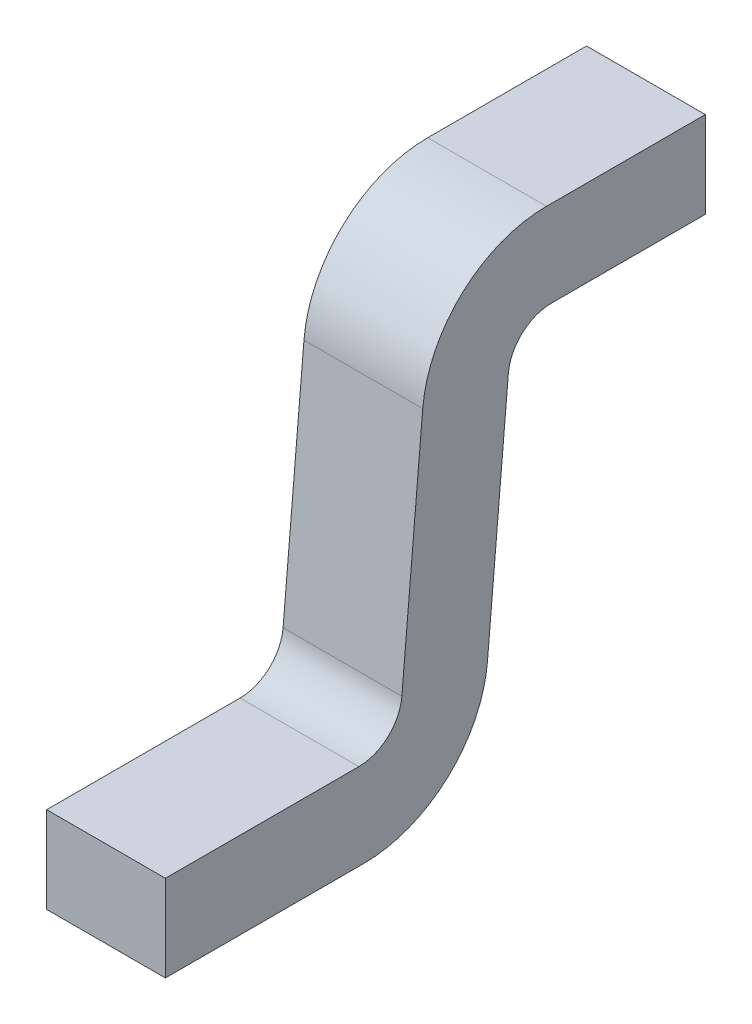
ISO-10303-21;
HEADER;
FILE_DESCRIPTION(('STEP AP214'),'2;1');
FILE_NAME('part.step','',(''),(''),'','','');
FILE_SCHEMA(('AUTOMOTIVE_DESIGN { 1 0 10303 214 1 1 1 1 }'));
ENDSEC;
DATA;
#1=APPLICATION_CONTEXT('core data for automotive mechanical design processes');
#2=APPLICATION_PROTOCOL_DEFINITION('international standard','automotive_design',2000,#1);
#3=PRODUCT_CONTEXT('',#1,'mechanical');
#4=PRODUCT('Part','Part','',(#3));
#5=PRODUCT_RELATED_PRODUCT_CATEGORY('part','',(#4));
#6=PRODUCT_DEFINITION_FORMATION('','',#4);
#7=PRODUCT_DEFINITION_CONTEXT('part definition',#1,'design');
#8=PRODUCT_DEFINITION('design','',#6,#7);
#9=PRODUCT_DEFINITION_SHAPE('','',#8);
#10=(LENGTH_UNIT() NAMED_UNIT(*) SI_UNIT(.MILLI.,.METRE.));
#11=(NAMED_UNIT(*) PLANE_ANGLE_UNIT() SI_UNIT($,.RADIAN.));
#12=(NAMED_UNIT(*) SI_UNIT($,.STERADIAN.) SOLID_ANGLE_UNIT());
#13=UNCERTAINTY_MEASURE_WITH_UNIT(LENGTH_MEASURE(1.E-05),#10,'distance_accuracy_value','');
#14=(GEOMETRIC_REPRESENTATION_CONTEXT(3) GLOBAL_UNCERTAINTY_ASSIGNED_CONTEXT((#13)) GLOBAL_UNIT_ASSIGNED_CONTEXT((#10,
#11,#12)) REPRESENTATION_CONTEXT('',''));
#15=CARTESIAN_POINT('',(0.,0.,0.));
#16=DIRECTION('',(0.,0.,1.));
#17=DIRECTION('',(1.,0.,0.));
#18=AXIS2_PLACEMENT_3D('',#15,#16,#17);
#19=CARTESIAN_POINT('',(0.11,0.,0.));
#20=DIRECTION('',(1.,0.,0.));
#21=DIRECTION('',(0.,0.,-1.));
#22=AXIS2_PLACEMENT_3D('',#19,#20,#21);
#23=PLANE('',#22);
#24=CARTESIAN_POINT('',(0.11,0.405,-0.105700297356));
#25=DIRECTION('',(-1.,0.,0.));
#26=DIRECTION('',(0.,0.,1.));
#27=AXIS2_PLACEMENT_3D('',#24,#25,#26);
#28=CIRCLE('',#27,0.23);
#29=CARTESIAN_POINT('',(0.11,0.42504582083198,0.123424483205085));
#30=VERTEX_POINT('',#29);
#31=CARTESIAN_POINT('',(0.11,0.635,-0.105700297356));
#32=VERTEX_POINT('',#31);
#33=EDGE_CURVE('E195',#30,#32,#28,.T.);
#34=ORIENTED_EDGE('',*,*,#33,.F.);
#35=DIRECTION('',(0.,-0.996194698091745,0.0871557427476639));
#36=VECTOR('',#35,1.);
#37=CARTESIAN_POINT('',(0.11,0.01394491883963,0.1593911516947));
#38=LINE('',#37,#36);
#39=CARTESIAN_POINT('',(0.11,-0.0169724594198097,0.162096071798352));
#40=VERTEX_POINT('',#39);
#41=EDGE_CURVE('E192',#40,#30,#38,.F.);
#42=ORIENTED_EDGE('',*,*,#41,.F.);
#43=CARTESIAN_POINT('',(0.11,-0.01,0.2417916476457));
#44=DIRECTION('',(1.,0.,0.));
#45=DIRECTION('',(0.,0.,-1.));
#46=AXIS2_PLACEMENT_3D('',#43,#44,#45);
#47=CIRCLE('',#46,0.08);
#48=CARTESIAN_POINT('',(0.11,-0.09,0.2417916476457));
#49=VERTEX_POINT('',#48);
#50=EDGE_CURVE('E189',#40,#49,#47,.F.);
#51=ORIENTED_EDGE('',*,*,#50,.T.);
#52=DIRECTION('',(0.,0.,1.));
#53=VECTOR('',#52,1.);
#54=CARTESIAN_POINT('',(0.11,-0.09,0.1684851537243));
#55=LINE('',#54,#53);
#56=CARTESIAN_POINT('',(0.11,-0.09,0.6));
#57=VERTEX_POINT('',#56);
#58=EDGE_CURVE('E185',#57,#49,#55,.F.);
#59=ORIENTED_EDGE('',*,*,#58,.F.);
#60=DIRECTION('',(0.,1.,0.));
#61=VECTOR('',#60,1.);
#62=CARTESIAN_POINT('',(0.11,-0.09,0.6));
#63=LINE('',#62,#61);
#64=CARTESIAN_POINT('',(0.11,-0.25,0.6));
#65=VERTEX_POINT('',#64);
#66=EDGE_CURVE('E125',#65,#57,#63,.T.);
#67=ORIENTED_EDGE('',*,*,#66,.F.);
#68=DIRECTION('',(0.,0.,-1.));
#69=VECTOR('',#68,1.);
#70=CARTESIAN_POINT('',(0.11,-0.25,0.6));
#71=LINE('',#70,#69);
#72=CARTESIAN_POINT('',(0.11,-0.25,0.2326283359055));
#73=VERTEX_POINT('',#72);
#74=EDGE_CURVE('E129',#73,#65,#71,.F.);
#75=ORIENTED_EDGE('',*,*,#74,.F.);
#76=CARTESIAN_POINT('',(0.11,-0.02,0.2326283359055));
#77=DIRECTION('',(-1.,0.,0.));
#78=DIRECTION('',(0.,0.,1.));
#79=AXIS2_PLACEMENT_3D('',#76,#77,#78);
#80=CIRCLE('',#79,0.23);
#81=CARTESIAN_POINT('',(0.11,-0.0400458208319614,0.00350355534439158));
#82=VERTEX_POINT('',#81);
#83=EDGE_CURVE('E173',#82,#73,#80,.T.);
#84=ORIENTED_EDGE('',*,*,#83,.F.);
#85=DIRECTION('',(0.,0.996194698091745,-0.0871557427476639));
#86=VECTOR('',#85,1.);
#87=CARTESIAN_POINT('',(0.11,-0.25,0.02187216588148));
#88=LINE('',#87,#86);
#89=CARTESIAN_POINT('',(0.11,0.401972459419806,-0.0351680332488661));
#90=VERTEX_POINT('',#89);
#91=EDGE_CURVE('E89',#90,#82,#88,.F.);
#92=ORIENTED_EDGE('',*,*,#91,.F.);
#93=CARTESIAN_POINT('',(0.11,0.395,-0.1148636090962));
#94=DIRECTION('',(1.,0.,0.));
#95=DIRECTION('',(0.,0.,-1.));
#96=AXIS2_PLACEMENT_3D('',#93,#94,#95);
#97=CIRCLE('',#96,0.08);
#98=CARTESIAN_POINT('',(0.11,0.475,-0.1148636090962));
#99=VERTEX_POINT('',#98);
#100=EDGE_CURVE('E19',#90,#99,#97,.F.);
#101=ORIENTED_EDGE('',*,*,#100,.T.);
#102=DIRECTION('',(0.,0.,-1.));
#103=VECTOR('',#102,1.);
#104=CARTESIAN_POINT('',(0.11,0.475,-0.04155711517481));
#105=LINE('',#104,#103);
#106=CARTESIAN_POINT('',(0.11,0.475,-0.4));
#107=VERTEX_POINT('',#106);
#108=EDGE_CURVE('E95',#107,#99,#105,.F.);
#109=ORIENTED_EDGE('',*,*,#108,.F.);
#110=DIRECTION('',(0.,1.,0.));
#111=VECTOR('',#110,1.);
#112=CARTESIAN_POINT('',(0.11,0.475,-0.4));
#113=LINE('',#112,#111);
#114=CARTESIAN_POINT('',(0.11,0.635,-0.4));
#115=VERTEX_POINT('',#114);
#116=EDGE_CURVE('E101',#115,#107,#113,.F.);
#117=ORIENTED_EDGE('',*,*,#116,.F.);
#118=DIRECTION('',(0.,0.,1.));
#119=VECTOR('',#118,1.);
#120=CARTESIAN_POINT('',(0.11,0.635,-0.4));
#121=LINE('',#120,#119);
#122=EDGE_CURVE('E107',#32,#115,#121,.F.);
#123=ORIENTED_EDGE('',*,*,#122,.F.);
#124=EDGE_LOOP('',(#34,#42,#51,#59,#67,#75,#84,#92,#101,#109,#117,#123));
#125=FACE_BOUND('',#124,.T.);
#126=ADVANCED_FACE('F16',(#125),#23,.T.);
#127=CARTESIAN_POINT('',(-0.11,-0.25,0.02187216588148));
#128=DIRECTION('',(0.,-0.0871557427476639,-0.996194698091745));
#129=DIRECTION('',(0.,0.996194698091745,-0.0871557427476639));
#130=AXIS2_PLACEMENT_3D('',#127,#128,#129);
#131=PLANE('',#130);
#132=DIRECTION('',(1.,0.,0.));
#133=VECTOR('',#132,1.);
#134=CARTESIAN_POINT('',(-0.11,0.401972459419801,-0.0351680332488593));
#135=LINE('',#134,#133);
#136=CARTESIAN_POINT('',(-0.11,0.401972459419807,-0.0351680332488652));
#137=VERTEX_POINT('',#136);
#138=EDGE_CURVE('E210',#137,#90,#135,.T.);
#139=ORIENTED_EDGE('',*,*,#138,.T.);
#140=ORIENTED_EDGE('',*,*,#91,.T.);
#141=DIRECTION('',(-1.,0.,0.));
#142=VECTOR('',#141,1.);
#143=CARTESIAN_POINT('',(-0.11,-0.040045820831959,0.00350355534439829));
#144=LINE('',#143,#142);
#145=CARTESIAN_POINT('',(-0.11,-0.0400458208319615,0.00350355534439284));
#146=VERTEX_POINT('',#145);
#147=EDGE_CURVE('E171',#146,#82,#144,.F.);
#148=ORIENTED_EDGE('',*,*,#147,.F.);
#149=DIRECTION('',(0.,0.996194698091745,-0.0871557427476653));
#150=VECTOR('',#149,1.);
#151=CARTESIAN_POINT('',(-0.11,-0.04004582083196,0.003503555344387));
#152=LINE('',#151,#150);
#153=EDGE_CURVE('E168',#146,#137,#152,.T.);
#154=ORIENTED_EDGE('',*,*,#153,.T.);
#155=EDGE_LOOP('',(#139,#140,#148,#154));
#156=FACE_BOUND('',#155,.T.);
#157=ADVANCED_FACE('F256',(#156),#131,.T.);
#158=CARTESIAN_POINT('',(-0.11,0.395,-0.1148636090962));
#159=DIRECTION('',(1.,0.,0.));
#160=DIRECTION('',(0.,0.,-1.));
#161=AXIS2_PLACEMENT_3D('',#158,#159,#160);
#162=CYLINDRICAL_SURFACE('',#161,0.08);
#163=ORIENTED_EDGE('',*,*,#138,.F.);
#164=CARTESIAN_POINT('',(-0.11,0.395,-0.1148636090962));
#165=DIRECTION('',(1.,0.,0.));
#166=DIRECTION('',(0.,0.,-1.));
#167=AXIS2_PLACEMENT_3D('',#164,#165,#166);
#168=CIRCLE('',#167,0.08);
#169=CARTESIAN_POINT('',(-0.11,0.475,-0.1148636090962));
#170=VERTEX_POINT('',#169);
#171=EDGE_CURVE('E165',#137,#170,#168,.F.);
#172=ORIENTED_EDGE('',*,*,#171,.T.);
#173=DIRECTION('',(1.,0.,0.));
#174=VECTOR('',#173,1.);
#175=CARTESIAN_POINT('',(-0.11,0.475,-0.1148636090962));
#176=LINE('',#175,#174);
#177=EDGE_CURVE('E208',#99,#170,#176,.F.);
#178=ORIENTED_EDGE('',*,*,#177,.F.);
#179=ORIENTED_EDGE('',*,*,#100,.F.);
#180=EDGE_LOOP('',(#163,#172,#178,#179));
#181=FACE_BOUND('',#180,.T.);
#182=ADVANCED_FACE('F254',(#181),#162,.F.);
#183=CARTESIAN_POINT('',(-0.11,0.475,-0.04155711517481));
#184=DIRECTION('',(0.,-1.,0.));
#185=DIRECTION('',(0.,0.,-1.));
#186=AXIS2_PLACEMENT_3D('',#183,#184,#185);
#187=PLANE('',#186);
#188=ORIENTED_EDGE('',*,*,#177,.T.);
#189=DIRECTION('',(0.,0.,-1.));
#190=VECTOR('',#189,1.);
#191=CARTESIAN_POINT('',(-0.11,0.475,0.));
#192=LINE('',#191,#190);
#193=CARTESIAN_POINT('',(-0.11,0.475,-0.4));
#194=VERTEX_POINT('',#193);
#195=EDGE_CURVE('E162',#170,#194,#192,.T.);
#196=ORIENTED_EDGE('',*,*,#195,.T.);
#197=DIRECTION('',(-1.,0.,0.));
#198=VECTOR('',#197,1.);
#199=CARTESIAN_POINT('',(-0.11,0.475,-0.4));
#200=LINE('',#199,#198);
#201=EDGE_CURVE('E204',#107,#194,#200,.T.);
#202=ORIENTED_EDGE('',*,*,#201,.F.);
#203=ORIENTED_EDGE('',*,*,#108,.T.);
#204=EDGE_LOOP('',(#188,#196,#202,#203));
#205=FACE_BOUND('',#204,.T.);
#206=ADVANCED_FACE('F250',(#205),#187,.T.);
#207=CARTESIAN_POINT('',(-0.11,0.475,-0.4));
#208=DIRECTION('',(0.,0.,-1.));
#209=DIRECTION('',(-1.,0.,0.));
#210=AXIS2_PLACEMENT_3D('',#207,#208,#209);
#211=PLANE('',#210);
#212=ORIENTED_EDGE('',*,*,#201,.T.);
#213=DIRECTION('',(0.,1.,0.));
#214=VECTOR('',#213,1.);
#215=CARTESIAN_POINT('',(-0.11,0.,-0.4));
#216=LINE('',#215,#214);
#217=CARTESIAN_POINT('',(-0.11,0.635,-0.4));
#218=VERTEX_POINT('',#217);
#219=EDGE_CURVE('E159',#194,#218,#216,.T.);
#220=ORIENTED_EDGE('',*,*,#219,.T.);
#221=DIRECTION('',(1.,0.,0.));
#222=VECTOR('',#221,1.);
#223=CARTESIAN_POINT('',(-0.11,0.635,-0.4));
#224=LINE('',#223,#222);
#225=EDGE_CURVE('E196',#115,#218,#224,.F.);
#226=ORIENTED_EDGE('',*,*,#225,.F.);
#227=ORIENTED_EDGE('',*,*,#116,.T.);
#228=EDGE_LOOP('',(#212,#220,#226,#227));
#229=FACE_BOUND('',#228,.T.);
#230=ADVANCED_FACE('F249',(#229),#211,.T.);
#231=CARTESIAN_POINT('',(-0.11,0.635,-0.4));
#232=DIRECTION('',(0.,1.,0.));
#233=DIRECTION('',(0.,0.,1.));
#234=AXIS2_PLACEMENT_3D('',#231,#232,#233);
#235=PLANE('',#234);
#236=ORIENTED_EDGE('',*,*,#225,.T.);
#237=DIRECTION('',(0.,0.,-1.));
#238=VECTOR('',#237,1.);
#239=CARTESIAN_POINT('',(-0.11,0.635,0.));
#240=LINE('',#239,#238);
#241=CARTESIAN_POINT('',(-0.11,0.635,-0.105700297356));
#242=VERTEX_POINT('',#241);
#243=EDGE_CURVE('E156',#218,#242,#240,.F.);
#244=ORIENTED_EDGE('',*,*,#243,.T.);
#245=DIRECTION('',(-1.,0.,0.));
#246=VECTOR('',#245,1.);
#247=CARTESIAN_POINT('',(-0.11,0.635,-0.105700297356));
#248=LINE('',#247,#246);
#249=EDGE_CURVE('E193',#32,#242,#248,.T.);
#250=ORIENTED_EDGE('',*,*,#249,.F.);
#251=ORIENTED_EDGE('',*,*,#122,.T.);
#252=EDGE_LOOP('',(#236,#244,#250,#251));
#253=FACE_BOUND('',#252,.T.);
#254=ADVANCED_FACE('F244',(#253),#235,.T.);
#255=CARTESIAN_POINT('',(-0.11,0.405,-0.105700297356));
#256=DIRECTION('',(-1.,0.,0.));
#257=DIRECTION('',(0.,0.,1.));
#258=AXIS2_PLACEMENT_3D('',#255,#256,#257);
#259=CYLINDRICAL_SURFACE('',#258,0.23);
#260=CARTESIAN_POINT('',(-0.11,0.405,-0.105700297356));
#261=DIRECTION('',(-1.,0.,0.));
#262=DIRECTION('',(0.,0.,1.));
#263=AXIS2_PLACEMENT_3D('',#260,#261,#262);
#264=CIRCLE('',#263,0.23);
#265=CARTESIAN_POINT('',(-0.11,0.425045820831965,0.123424483205095));
#266=VERTEX_POINT('',#265);
#267=EDGE_CURVE('E155',#242,#266,#264,.F.);
#268=ORIENTED_EDGE('',*,*,#267,.T.);
#269=DIRECTION('',(1.,0.,0.));
#270=VECTOR('',#269,1.);
#271=CARTESIAN_POINT('',(-0.11,0.425045820831999,0.123424483205083));
#272=LINE('',#271,#270);
#273=EDGE_CURVE('E190',#30,#266,#272,.F.);
#274=ORIENTED_EDGE('',*,*,#273,.F.);
#275=ORIENTED_EDGE('',*,*,#33,.T.);
#276=ORIENTED_EDGE('',*,*,#249,.T.);
#277=EDGE_LOOP('',(#268,#274,#275,#276));
#278=FACE_BOUND('',#277,.T.);
#279=ADVANCED_FACE('F242',(#278),#259,.T.);
#280=CARTESIAN_POINT('',(-0.11,0.01394491883963,0.1593911516947));
#281=DIRECTION('',(0.,0.0871557427476639,0.996194698091745));
#282=DIRECTION('',(0.,-0.996194698091745,0.0871557427476639));
#283=AXIS2_PLACEMENT_3D('',#280,#281,#282);
#284=PLANE('',#283);
#285=ORIENTED_EDGE('',*,*,#273,.T.);
#286=DIRECTION('',(0.,-0.996194698091757,0.087155742747528));
#287=VECTOR('',#286,1.);
#288=CARTESIAN_POINT('',(-0.11,0.425045820832,0.1234244832051));
#289=LINE('',#288,#287);
#290=CARTESIAN_POINT('',(-0.11,-0.0169724594198061,0.16209607179833));
#291=VERTEX_POINT('',#290);
#292=EDGE_CURVE('E145',#266,#291,#289,.T.);
#293=ORIENTED_EDGE('',*,*,#292,.T.);
#294=DIRECTION('',(1.,0.,0.));
#295=VECTOR('',#294,1.);
#296=CARTESIAN_POINT('',(-0.11,-0.0169724594198048,0.16209607179836));
#297=LINE('',#296,#295);
#298=EDGE_CURVE('E186',#291,#40,#297,.T.);
#299=ORIENTED_EDGE('',*,*,#298,.T.);
#300=ORIENTED_EDGE('',*,*,#41,.T.);
#301=EDGE_LOOP('',(#285,#293,#299,#300));
#302=FACE_BOUND('',#301,.T.);
#303=ADVANCED_FACE('F265',(#302),#284,.T.);
#304=CARTESIAN_POINT('',(-0.11,-0.01,0.2417916476457));
#305=DIRECTION('',(1.,0.,0.));
#306=DIRECTION('',(0.,0.,-1.));
#307=AXIS2_PLACEMENT_3D('',#304,#305,#306);
#308=CYLINDRICAL_SURFACE('',#307,0.08);
#309=ORIENTED_EDGE('',*,*,#298,.F.);
#310=CARTESIAN_POINT('',(-0.11,-0.01,0.2417916476457));
#311=DIRECTION('',(1.,0.,0.));
#312=DIRECTION('',(0.,0.,-1.));
#313=AXIS2_PLACEMENT_3D('',#310,#311,#312);
#314=CIRCLE('',#313,0.08);
#315=CARTESIAN_POINT('',(-0.11,-0.09,0.2417916476457));
#316=VERTEX_POINT('',#315);
#317=EDGE_CURVE('E143',#291,#316,#314,.F.);
#318=ORIENTED_EDGE('',*,*,#317,.T.);
#319=DIRECTION('',(1.,0.,0.));
#320=VECTOR('',#319,1.);
#321=CARTESIAN_POINT('',(-0.11,-0.09,0.2417916476457));
#322=LINE('',#321,#320);
#323=EDGE_CURVE('E142',#49,#316,#322,.F.);
#324=ORIENTED_EDGE('',*,*,#323,.F.);
#325=ORIENTED_EDGE('',*,*,#50,.F.);
#326=EDGE_LOOP('',(#309,#318,#324,#325));
#327=FACE_BOUND('',#326,.T.);
#328=ADVANCED_FACE('F263',(#327),#308,.F.);
#329=CARTESIAN_POINT('',(-0.11,-0.09,0.1684851537243));
#330=DIRECTION('',(0.,1.,0.));
#331=DIRECTION('',(0.,0.,1.));
#332=AXIS2_PLACEMENT_3D('',#329,#330,#331);
#333=PLANE('',#332);
#334=ORIENTED_EDGE('',*,*,#323,.T.);
#335=DIRECTION('',(0.,0.,-1.));
#336=VECTOR('',#335,1.);
#337=CARTESIAN_POINT('',(-0.11,-0.09,0.));
#338=LINE('',#337,#336);
#339=CARTESIAN_POINT('',(-0.11,-0.09,0.6));
#340=VERTEX_POINT('',#339);
#341=EDGE_CURVE('E136',#316,#340,#338,.F.);
#342=ORIENTED_EDGE('',*,*,#341,.T.);
#343=DIRECTION('',(1.,0.,0.));
#344=VECTOR('',#343,1.);
#345=CARTESIAN_POINT('',(-0.11,-0.09,0.6));
#346=LINE('',#345,#344);
#347=EDGE_CURVE('E119',#57,#340,#346,.F.);
#348=ORIENTED_EDGE('',*,*,#347,.F.);
#349=ORIENTED_EDGE('',*,*,#58,.T.);
#350=EDGE_LOOP('',(#334,#342,#348,#349));
#351=FACE_BOUND('',#350,.T.);
#352=ADVANCED_FACE('F140',(#351),#333,.T.);
#353=CARTESIAN_POINT('',(-0.11,-0.09,0.6));
#354=DIRECTION('',(0.,0.,1.));
#355=DIRECTION('',(1.,0.,0.));
#356=AXIS2_PLACEMENT_3D('',#353,#354,#355);
#357=PLANE('',#356);
#358=ORIENTED_EDGE('',*,*,#347,.T.);
#359=DIRECTION('',(0.,1.,0.));
#360=VECTOR('',#359,1.);
#361=CARTESIAN_POINT('',(-0.11,0.,0.6));
#362=LINE('',#361,#360);
#363=CARTESIAN_POINT('',(-0.11,-0.25,0.6));
#364=VERTEX_POINT('',#363);
#365=EDGE_CURVE('E123',#340,#364,#362,.F.);
#366=ORIENTED_EDGE('',*,*,#365,.T.);
#367=DIRECTION('',(1.,0.,0.));
#368=VECTOR('',#367,1.);
#369=CARTESIAN_POINT('',(-0.11,-0.25,0.6));
#370=LINE('',#369,#368);
#371=EDGE_CURVE('E176',#65,#364,#370,.F.);
#372=ORIENTED_EDGE('',*,*,#371,.F.);
#373=ORIENTED_EDGE('',*,*,#66,.T.);
#374=EDGE_LOOP('',(#358,#366,#372,#373));
#375=FACE_BOUND('',#374,.T.);
#376=ADVANCED_FACE('F121',(#375),#357,.T.);
#377=CARTESIAN_POINT('',(-0.11,-0.25,0.6));
#378=DIRECTION('',(0.,-1.,0.));
#379=DIRECTION('',(0.,0.,-1.));
#380=AXIS2_PLACEMENT_3D('',#377,#378,#379);
#381=PLANE('',#380);
#382=ORIENTED_EDGE('',*,*,#371,.T.);
#383=DIRECTION('',(0.,0.,-1.));
#384=VECTOR('',#383,1.);
#385=CARTESIAN_POINT('',(-0.11,-0.25,0.));
#386=LINE('',#385,#384);
#387=CARTESIAN_POINT('',(-0.11,-0.25,0.2326283359055));
#388=VERTEX_POINT('',#387);
#389=EDGE_CURVE('E25',#364,#388,#386,.T.);
#390=ORIENTED_EDGE('',*,*,#389,.T.);
#391=DIRECTION('',(-1.,0.,0.));
#392=VECTOR('',#391,1.);
#393=CARTESIAN_POINT('',(-0.11,-0.25,0.2326283359055));
#394=LINE('',#393,#392);
#395=EDGE_CURVE('E33',#73,#388,#394,.T.);
#396=ORIENTED_EDGE('',*,*,#395,.F.);
#397=ORIENTED_EDGE('',*,*,#74,.T.);
#398=EDGE_LOOP('',(#382,#390,#396,#397));
#399=FACE_BOUND('',#398,.T.);
#400=ADVANCED_FACE('F259',(#399),#381,.T.);
#401=CARTESIAN_POINT('',(-0.11,-0.02,0.2326283359055));
#402=DIRECTION('',(-1.,0.,0.));
#403=DIRECTION('',(0.,0.,1.));
#404=AXIS2_PLACEMENT_3D('',#401,#402,#403);
#405=CYLINDRICAL_SURFACE('',#404,0.23);
#406=CARTESIAN_POINT('',(-0.11,-0.02,0.2326283359055));
#407=DIRECTION('',(-1.,0.,0.));
#408=DIRECTION('',(0.,0.,1.));
#409=AXIS2_PLACEMENT_3D('',#406,#407,#408);
#410=CIRCLE('',#409,0.23);
#411=EDGE_CURVE('E10',#388,#146,#410,.F.);
#412=ORIENTED_EDGE('',*,*,#411,.T.);
#413=ORIENTED_EDGE('',*,*,#147,.T.);
#414=ORIENTED_EDGE('',*,*,#83,.T.);
#415=ORIENTED_EDGE('',*,*,#395,.T.);
#416=EDGE_LOOP('',(#412,#413,#414,#415));
#417=FACE_BOUND('',#416,.T.);
#418=ADVANCED_FACE('F276',(#417),#405,.T.);
#419=CARTESIAN_POINT('',(-0.11,0.,0.));
#420=DIRECTION('',(1.,0.,0.));
#421=DIRECTION('',(0.,0.,-1.));
#422=AXIS2_PLACEMENT_3D('',#419,#420,#421);
#423=PLANE('',#422);
#424=ORIENTED_EDGE('',*,*,#389,.F.);
#425=ORIENTED_EDGE('',*,*,#365,.F.);
#426=ORIENTED_EDGE('',*,*,#341,.F.);
#427=ORIENTED_EDGE('',*,*,#317,.F.);
#428=ORIENTED_EDGE('',*,*,#292,.F.);
#429=ORIENTED_EDGE('',*,*,#267,.F.);
#430=ORIENTED_EDGE('',*,*,#243,.F.);
#431=ORIENTED_EDGE('',*,*,#219,.F.);
#432=ORIENTED_EDGE('',*,*,#195,.F.);
#433=ORIENTED_EDGE('',*,*,#171,.F.);
#434=ORIENTED_EDGE('',*,*,#153,.F.);
#435=ORIENTED_EDGE('',*,*,#411,.F.);
#436=EDGE_LOOP('',(#424,#425,#426,#427,#428,#429,#430,#431,#432,#433,#434,#435));
#437=FACE_BOUND('',#436,.T.);
#438=ADVANCED_FACE('F134',(#437),#423,.F.);
#439=CLOSED_SHELL('',(#126,#157,#182,#206,#230,#254,#279,#303,#328,#352,#376,#400,#418,#438));
#440=MANIFOLD_SOLID_BREP('B1',#439);
#441=ADVANCED_BREP_SHAPE_REPRESENTATION('',(#18,#440),#14);
#442=SHAPE_DEFINITION_REPRESENTATION(#9,#441);
ENDSEC;
END-ISO-10303-21;
